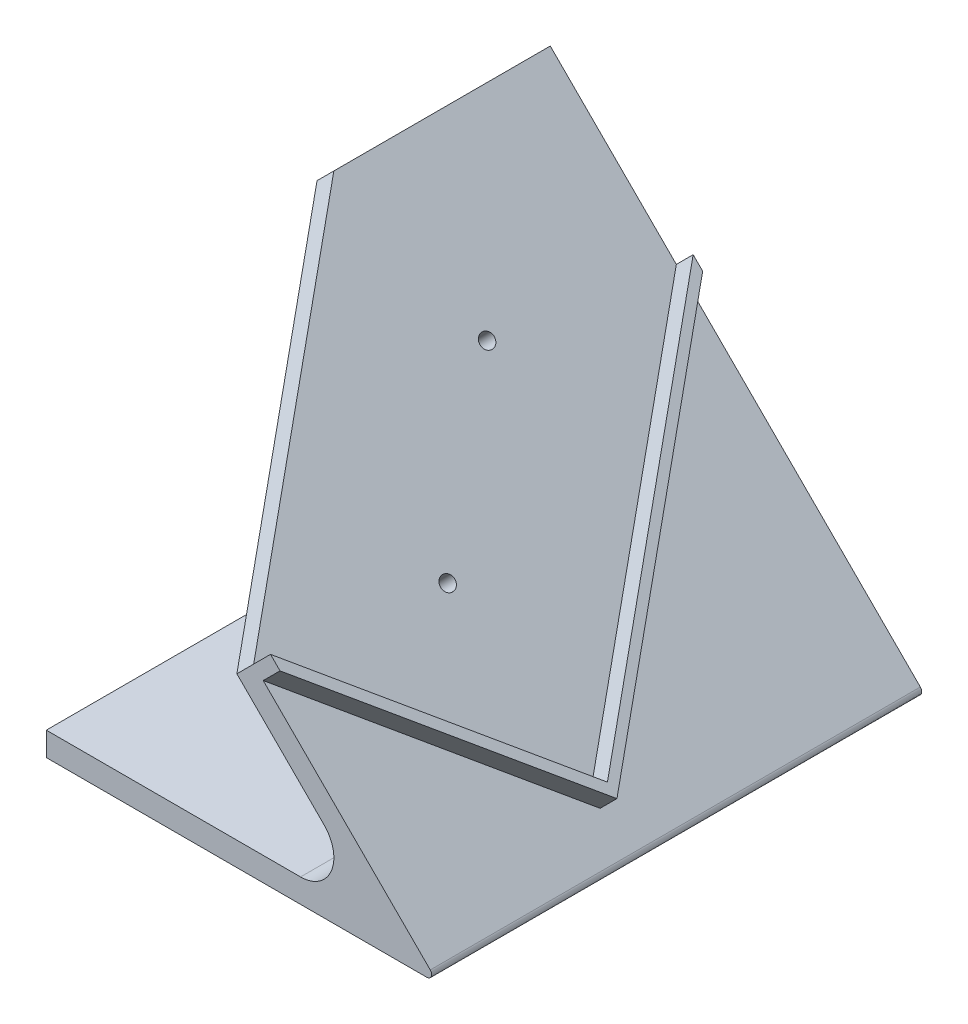
ISO-10303-21;
HEADER;
FILE_DESCRIPTION(('STEP AP214'),'2;1');
FILE_NAME('part.step','',(''),(''),'','','');
FILE_SCHEMA(('AUTOMOTIVE_DESIGN { 1 0 10303 214 1 1 1 1 }'));
ENDSEC;
DATA;
#1=APPLICATION_CONTEXT('core data for automotive mechanical design processes');
#2=APPLICATION_PROTOCOL_DEFINITION('international standard','automotive_design',2000,#1);
#3=PRODUCT_CONTEXT('',#1,'mechanical');
#4=PRODUCT('Part','Part','',(#3));
#5=PRODUCT_RELATED_PRODUCT_CATEGORY('part','',(#4));
#6=PRODUCT_DEFINITION_FORMATION('','',#4);
#7=PRODUCT_DEFINITION_CONTEXT('part definition',#1,'design');
#8=PRODUCT_DEFINITION('design','',#6,#7);
#9=PRODUCT_DEFINITION_SHAPE('','',#8);
#10=(LENGTH_UNIT() NAMED_UNIT(*) SI_UNIT(.MILLI.,.METRE.));
#11=(NAMED_UNIT(*) PLANE_ANGLE_UNIT() SI_UNIT($,.RADIAN.));
#12=(NAMED_UNIT(*) SI_UNIT($,.STERADIAN.) SOLID_ANGLE_UNIT());
#13=UNCERTAINTY_MEASURE_WITH_UNIT(LENGTH_MEASURE(1.E-05),#10,'distance_accuracy_value','');
#14=(GEOMETRIC_REPRESENTATION_CONTEXT(3) GLOBAL_UNCERTAINTY_ASSIGNED_CONTEXT((#13)) GLOBAL_UNIT_ASSIGNED_CONTEXT((#10,
#11,#12)) REPRESENTATION_CONTEXT('',''));
#15=CARTESIAN_POINT('',(0.,0.,0.));
#16=DIRECTION('',(0.,0.,1.));
#17=DIRECTION('',(1.,0.,0.));
#18=AXIS2_PLACEMENT_3D('',#15,#16,#17);
#19=CARTESIAN_POINT('',(2.92536085066658,74.4888527117072,103.));
#20=DIRECTION('',(-0.707106781186549,-0.707106781186546,0.));
#21=DIRECTION('',(0.707106781186546,-0.707106781186549,0.));
#22=AXIS2_PLACEMENT_3D('',#19,#20,#21);
#23=PLANE('',#22);
#24=CARTESIAN_POINT('',(46.4253608506667,30.9888527117069,65.0538238691621));
#25=DIRECTION('',(0.707106781186549,0.707106781186546,0.));
#26=DIRECTION('',(-0.707106781186546,0.707106781186549,0.));
#27=AXIS2_PLACEMENT_3D('',#24,#25,#26);
#28=CIRCLE('',#27,1.49999999999999);
#29=CARTESIAN_POINT('',(45.3647006788869,32.0495128834867,65.0538238691621));
#30=VERTEX_POINT('',#29);
#31=EDGE_CURVE('E454',#30,#30,#28,.T.);
#32=ORIENTED_EDGE('',*,*,#31,.F.);
#33=EDGE_LOOP('',(#32));
#34=FACE_BOUND('',#33,.T.);
#35=CARTESIAN_POINT('',(26.4253608506667,50.988852711707,36.7695526217004));
#36=DIRECTION('',(0.707106781186549,0.707106781186546,0.));
#37=DIRECTION('',(-0.707106781186546,0.707106781186549,0.));
#38=AXIS2_PLACEMENT_3D('',#35,#36,#37);
#39=CIRCLE('',#38,1.49999999999999);
#40=CARTESIAN_POINT('',(25.3647006788869,52.0495128834869,36.7695526217004));
#41=VERTEX_POINT('',#40);
#42=EDGE_CURVE('E456',#41,#41,#39,.T.);
#43=ORIENTED_EDGE('',*,*,#42,.F.);
#44=EDGE_LOOP('',(#43));
#45=FACE_BOUND('',#44,.T.);
#46=DIRECTION('',(0.500000000000002,-0.500000000000004,0.707106781186544));
#47=VECTOR('',#46,1.);
#48=CARTESIAN_POINT('',(43.5933623884523,33.8208511739213,103.));
#49=LINE('',#48,#47);
#50=CARTESIAN_POINT('',(2.92536085066658,74.4888527117072,45.486760670654));
#51=VERTEX_POINT('',#50);
#52=CARTESIAN_POINT('',(43.5933623884523,33.8208511739213,103.));
#53=VERTEX_POINT('',#52);
#54=EDGE_CURVE('E163',#51,#53,#49,.T.);
#55=ORIENTED_EDGE('',*,*,#54,.T.);
#56=DIRECTION('',(0.499999999999996,-0.499999999999998,-0.707106781186552));
#57=VECTOR('',#56,1.);
#58=CARTESIAN_POINT('',(77.5662338159268,-0.152020253553244,54.9551044745076));
#59=LINE('',#58,#57);
#60=CARTESIAN_POINT('',(72.9253608506666,4.48885271170697,61.5182899632293));
#61=VERTEX_POINT('',#60);
#62=EDGE_CURVE('E139',#53,#61,#59,.T.);
#63=ORIENTED_EDGE('',*,*,#62,.T.);
#64=DIRECTION('',(-0.500000000000003,0.500000000000005,-0.707106781186542));
#65=VECTOR('',#64,1.);
#66=CARTESIAN_POINT('',(34.0662338159267,43.347979746447,6.56318548872171));
#67=LINE('',#66,#65);
#68=CARTESIAN_POINT('',(29.4253608506664,47.9888527117073,0.));
#69=VERTEX_POINT('',#68);
#70=EDGE_CURVE('E151',#61,#69,#67,.T.);
#71=ORIENTED_EDGE('',*,*,#70,.T.);
#72=DIRECTION('',(-0.707106781186546,0.707106781186549,0.));
#73=VECTOR('',#72,1.);
#74=CARTESIAN_POINT('',(2.92536085066658,74.4888527117072,0.));
#75=LINE('',#74,#73);
#76=CARTESIAN_POINT('',(2.92536085066658,74.4888527117072,0.));
#77=VERTEX_POINT('',#76);
#78=EDGE_CURVE('E223',#69,#77,#75,.T.);
#79=ORIENTED_EDGE('',*,*,#78,.T.);
#80=DIRECTION('',(0.,0.,-1.));
#81=VECTOR('',#80,1.);
#82=CARTESIAN_POINT('',(2.92536085066658,74.4888527117072,103.));
#83=LINE('',#82,#81);
#84=EDGE_CURVE('E43',#51,#77,#83,.T.);
#85=ORIENTED_EDGE('',*,*,#84,.F.);
#86=EDGE_LOOP('',(#55,#63,#71,#79,#85));
#87=FACE_BOUND('',#86,.T.);
#88=ADVANCED_FACE('F35',(#34,#45,#87),#23,.F.);
#89=CARTESIAN_POINT('',(2.92536085066658,74.4888527117072,103.));
#90=DIRECTION('',(0.707106781186544,-0.707106781186551,0.));
#91=DIRECTION('',(0.707106781186551,0.707106781186544,0.));
#92=AXIS2_PLACEMENT_3D('',#89,#90,#91);
#93=PLANE('',#92);
#94=DIRECTION('',(-0.707106781186549,-0.707106781186546,0.));
#95=VECTOR('',#94,1.);
#96=CARTESIAN_POINT('',(138.6747221853,210.238214046341,45.486760670654));
#97=LINE('',#96,#95);
#98=CARTESIAN_POINT('',(-0.610173055266174,70.9533188057745,45.486760670654));
#99=VERTEX_POINT('',#98);
#100=EDGE_CURVE('E50',#51,#99,#97,.T.);
#101=ORIENTED_EDGE('',*,*,#100,.F.);
#102=ORIENTED_EDGE('',*,*,#84,.T.);
#103=DIRECTION('',(-0.707106781186551,-0.707106781186544,0.));
#104=VECTOR('',#103,1.);
#105=CARTESIAN_POINT('',(2.92536085066658,74.4888527117072,0.));
#106=LINE('',#105,#104);
#107=CARTESIAN_POINT('',(-0.610173055266174,70.9533188057745,0.));
#108=VERTEX_POINT('',#107);
#109=EDGE_CURVE('E226',#77,#108,#106,.T.);
#110=ORIENTED_EDGE('',*,*,#109,.T.);
#111=DIRECTION('',(0.,0.,-1.));
#112=VECTOR('',#111,1.);
#113=CARTESIAN_POINT('',(-0.610173055266174,70.9533188057745,103.));
#114=LINE('',#113,#112);
#115=EDGE_CURVE('E252',#99,#108,#114,.T.);
#116=ORIENTED_EDGE('',*,*,#115,.F.);
#117=EDGE_LOOP('',(#101,#102,#110,#116));
#118=FACE_BOUND('',#117,.T.);
#119=ADVANCED_FACE('F253',(#118),#93,.F.);
#120=CARTESIAN_POINT('',(58.3933982822023,11.9497474683058,103.));
#121=DIRECTION('',(0.707106781186549,0.707106781186546,0.));
#122=DIRECTION('',(-0.707106781186546,0.707106781186549,0.));
#123=AXIS2_PLACEMENT_3D('',#120,#121,#122);
#124=PLANE('',#123);
#125=CARTESIAN_POINT('',(42.889826944734,27.4533188057742,65.0538238691621));
#126=DIRECTION('',(0.707106781186549,0.707106781186546,0.));
#127=DIRECTION('',(-0.707106781186546,0.707106781186549,0.));
#128=AXIS2_PLACEMENT_3D('',#125,#126,#127);
#129=CIRCLE('',#128,1.49999999999999);
#130=CARTESIAN_POINT('',(41.8291667729542,28.513978977554,65.0538238691621));
#131=VERTEX_POINT('',#130);
#132=EDGE_CURVE('E452',#131,#131,#129,.T.);
#133=ORIENTED_EDGE('',*,*,#132,.T.);
#134=EDGE_LOOP('',(#133));
#135=FACE_BOUND('',#134,.T.);
#136=CARTESIAN_POINT('',(22.8898269447339,47.4533188057743,36.7695526217004));
#137=DIRECTION('',(0.707106781186549,0.707106781186546,0.));
#138=DIRECTION('',(-0.707106781186546,0.707106781186549,0.));
#139=AXIS2_PLACEMENT_3D('',#136,#137,#138);
#140=CIRCLE('',#139,1.49999999999999);
#141=CARTESIAN_POINT('',(21.8291667729541,48.5139789775541,36.7695526217004));
#142=VERTEX_POINT('',#141);
#143=EDGE_CURVE('E166',#142,#142,#140,.T.);
#144=ORIENTED_EDGE('',*,*,#143,.T.);
#145=EDGE_LOOP('',(#144));
#146=FACE_BOUND('',#145,.T.);
#147=DIRECTION('',(0.500000000000002,-0.500000000000004,0.707106781186544));
#148=VECTOR('',#147,1.);
#149=CARTESIAN_POINT('',(40.0578284825196,30.2853172679886,103.));
#150=LINE('',#149,#148);
#151=CARTESIAN_POINT('',(40.0578284825196,30.2853172679886,103.));
#152=VERTEX_POINT('',#151);
#153=EDGE_CURVE('E58',#99,#152,#150,.T.);
#154=ORIENTED_EDGE('',*,*,#153,.F.);
#155=ORIENTED_EDGE('',*,*,#115,.T.);
#156=DIRECTION('',(0.707106781186546,-0.707106781186549,0.));
#157=VECTOR('',#156,1.);
#158=CARTESIAN_POINT('',(58.3933982822023,11.9497474683058,0.));
#159=LINE('',#158,#157);
#160=CARTESIAN_POINT('',(58.3933982822023,11.9497474683058,0.));
#161=VERTEX_POINT('',#160);
#162=EDGE_CURVE('E229',#108,#161,#159,.T.);
#163=ORIENTED_EDGE('',*,*,#162,.T.);
#164=DIRECTION('',(0.,0.,-1.));
#165=VECTOR('',#164,1.);
#166=CARTESIAN_POINT('',(58.3933982822023,11.9497474683058,103.));
#167=LINE('',#166,#165);
#168=CARTESIAN_POINT('',(58.3933982822023,11.9497474683058,103.));
#169=VERTEX_POINT('',#168);
#170=EDGE_CURVE('E249',#169,#161,#167,.T.);
#171=ORIENTED_EDGE('',*,*,#170,.F.);
#172=DIRECTION('',(0.707106781186546,-0.707106781186549,0.));
#173=VECTOR('',#172,1.);
#174=CARTESIAN_POINT('',(58.3933982822023,11.9497474683058,103.));
#175=LINE('',#174,#173);
#176=EDGE_CURVE('E210',#152,#169,#175,.T.);
#177=ORIENTED_EDGE('',*,*,#176,.F.);
#178=EDGE_LOOP('',(#154,#155,#163,#171,#177));
#179=FACE_BOUND('',#178,.T.);
#180=ADVANCED_FACE('F263',(#135,#146,#179),#124,.F.);
#181=CARTESIAN_POINT('',(80.,-3.99999999999982,103.));
#182=DIRECTION('',(0.,0.,-1.));
#183=DIRECTION('',(-1.,0.,0.));
#184=AXIS2_PLACEMENT_3D('',#181,#182,#183);
#185=PLANE('',#184);
#186=DIRECTION('',(-0.707106781186549,-0.707106781186546,0.));
#187=VECTOR('',#186,1.);
#188=CARTESIAN_POINT('',(179.342723723086,169.570212508555,103.));
#189=LINE('',#188,#187);
#190=EDGE_CURVE('E156',#53,#152,#189,.T.);
#191=ORIENTED_EDGE('',*,*,#190,.T.);
#192=ORIENTED_EDGE('',*,*,#176,.T.);
#193=CARTESIAN_POINT('',(53.4436508138965,7.,103.));
#194=DIRECTION('',(0.,0.,-1.));
#195=DIRECTION('',(1.,0.,0.));
#196=AXIS2_PLACEMENT_3D('',#193,#194,#195);
#197=CIRCLE('',#196,7.);
#198=CARTESIAN_POINT('',(53.4436508138965,0.,103.));
#199=VERTEX_POINT('',#198);
#200=EDGE_CURVE('E212',#169,#199,#197,.T.);
#201=ORIENTED_EDGE('',*,*,#200,.T.);
#202=DIRECTION('',(-1.,0.,0.));
#203=VECTOR('',#202,1.);
#204=CARTESIAN_POINT('',(0.,0.,103.));
#205=LINE('',#204,#203);
#206=CARTESIAN_POINT('',(0.,0.,103.));
#207=VERTEX_POINT('',#206);
#208=EDGE_CURVE('E214',#199,#207,#205,.T.);
#209=ORIENTED_EDGE('',*,*,#208,.T.);
#210=DIRECTION('',(0.,-1.,0.));
#211=VECTOR('',#210,1.);
#212=CARTESIAN_POINT('',(0.,-5.,103.));
#213=LINE('',#212,#211);
#214=CARTESIAN_POINT('',(0.,-5.,103.));
#215=VERTEX_POINT('',#214);
#216=EDGE_CURVE('E216',#207,#215,#213,.T.);
#217=ORIENTED_EDGE('',*,*,#216,.T.);
#218=DIRECTION('',(1.,0.,0.));
#219=VECTOR('',#218,1.);
#220=CARTESIAN_POINT('',(80.,-4.99999999999999,103.));
#221=LINE('',#220,#219);
#222=CARTESIAN_POINT('',(80.,-4.99999999999999,103.));
#223=VERTEX_POINT('',#222);
#224=EDGE_CURVE('E218',#215,#223,#221,.T.);
#225=ORIENTED_EDGE('',*,*,#224,.T.);
#226=CARTESIAN_POINT('',(80.,-3.99999999999982,103.));
#227=DIRECTION('',(0.,0.,1.));
#228=DIRECTION('',(-1.,0.,0.));
#229=AXIS2_PLACEMENT_3D('',#226,#227,#228);
#230=CIRCLE('',#229,1.00000000000017);
#231=CARTESIAN_POINT('',(80.7071067811867,-3.29289321881315,103.));
#232=VERTEX_POINT('',#231);
#233=EDGE_CURVE('E203',#223,#232,#230,.T.);
#234=ORIENTED_EDGE('',*,*,#233,.T.);
#235=DIRECTION('',(-0.707106781186546,0.707106781186549,0.));
#236=VECTOR('',#235,1.);
#237=CARTESIAN_POINT('',(2.92536085066658,74.4888527117072,103.));
#238=LINE('',#237,#236);
#239=CARTESIAN_POINT('',(45.5933623884522,31.8208511739214,103.));
#240=VERTEX_POINT('',#239);
#241=EDGE_CURVE('E206',#232,#240,#238,.T.);
#242=ORIENTED_EDGE('',*,*,#241,.T.);
#243=DIRECTION('',(-0.707106781186549,-0.707106781186546,0.));
#244=VECTOR('',#243,1.);
#245=CARTESIAN_POINT('',(49.1288962943849,35.3563850798542,103.));
#246=LINE('',#245,#244);
#247=CARTESIAN_POINT('',(49.1288962943849,35.3563850798542,103.));
#248=VERTEX_POINT('',#247);
#249=EDGE_CURVE('E160',#248,#240,#246,.T.);
#250=ORIENTED_EDGE('',*,*,#249,.F.);
#251=DIRECTION('',(0.707106781186546,-0.707106781186549,0.));
#252=VECTOR('',#251,1.);
#253=CARTESIAN_POINT('',(42.2426406871196,42.2426406871195,103.));
#254=LINE('',#253,#252);
#255=CARTESIAN_POINT('',(47.1288962943851,37.356385079854,103.));
#256=VERTEX_POINT('',#255);
#257=EDGE_CURVE('E158',#256,#248,#254,.T.);
#258=ORIENTED_EDGE('',*,*,#257,.F.);
#259=DIRECTION('',(-0.707106781186549,-0.707106781186546,0.));
#260=VECTOR('',#259,1.);
#261=CARTESIAN_POINT('',(47.1288962943851,37.356385079854,103.));
#262=LINE('',#261,#260);
#263=EDGE_CURVE('E143',#256,#53,#262,.T.);
#264=ORIENTED_EDGE('',*,*,#263,.T.);
#265=EDGE_LOOP('',(#191,#192,#201,#209,#217,#225,#234,#242,#250,#258,#264));
#266=FACE_BOUND('',#265,.T.);
#267=ADVANCED_FACE('F154',(#266),#185,.F.);
#268=DIRECTION('',(0.499999999999997,-0.499999999999998,-0.707106781186551));
#269=VECTOR('',#268,1.);
#270=CARTESIAN_POINT('',(78.5662338159267,-1.15202025355317,56.3693180368806));
#271=LINE('',#270,#269);
#272=CARTESIAN_POINT('',(74.9253608506665,2.48885271170702,61.5182899632292));
#273=VERTEX_POINT('',#272);
#274=EDGE_CURVE('E150',#240,#273,#271,.T.);
#275=ORIENTED_EDGE('',*,*,#274,.F.);
#276=ORIENTED_EDGE('',*,*,#241,.F.);
#277=DIRECTION('',(0.,0.,-1.));
#278=VECTOR('',#277,1.);
#279=CARTESIAN_POINT('',(80.7071067811867,-3.29289321881315,103.));
#280=LINE('',#279,#278);
#281=CARTESIAN_POINT('',(80.7071067811867,-3.29289321881315,0.));
#282=VERTEX_POINT('',#281);
#283=EDGE_CURVE('E11',#232,#282,#280,.T.);
#284=ORIENTED_EDGE('',*,*,#283,.T.);
#285=CARTESIAN_POINT('',(31.4253608506664,45.9888527117073,0.));
#286=VERTEX_POINT('',#285);
#287=EDGE_CURVE('E224',#282,#286,#75,.T.);
#288=ORIENTED_EDGE('',*,*,#287,.T.);
#289=DIRECTION('',(-0.500000000000002,0.500000000000004,-0.707106781186544));
#290=VECTOR('',#289,1.);
#291=CARTESIAN_POINT('',(35.0662338159267,42.347979746447,5.14897192634861));
#292=LINE('',#291,#290);
#293=EDGE_CURVE('E177',#273,#286,#292,.T.);
#294=ORIENTED_EDGE('',*,*,#293,.F.);
#295=EDGE_LOOP('',(#275,#276,#284,#288,#294));
#296=FACE_BOUND('',#295,.T.);
#297=ADVANCED_FACE('F286',(#296),#23,.F.);
#298=CARTESIAN_POINT('',(80.,-3.99999999999982,103.));
#299=DIRECTION('',(0.,0.,-1.));
#300=DIRECTION('',(-1.,0.,0.));
#301=AXIS2_PLACEMENT_3D('',#298,#299,#300);
#302=CYLINDRICAL_SURFACE('',#301,1.00000000000017);
#303=CARTESIAN_POINT('',(80.,-3.99999999999982,0.));
#304=DIRECTION('',(0.,0.,1.));
#305=DIRECTION('',(-1.,0.,0.));
#306=AXIS2_PLACEMENT_3D('',#303,#304,#305);
#307=CIRCLE('',#306,1.00000000000017);
#308=CARTESIAN_POINT('',(80.,-4.99999999999999,0.));
#309=VERTEX_POINT('',#308);
#310=EDGE_CURVE('E202',#309,#282,#307,.T.);
#311=ORIENTED_EDGE('',*,*,#310,.T.);
#312=ORIENTED_EDGE('',*,*,#283,.F.);
#313=ORIENTED_EDGE('',*,*,#233,.F.);
#314=DIRECTION('',(0.,0.,-1.));
#315=VECTOR('',#314,1.);
#316=CARTESIAN_POINT('',(80.,-4.99999999999999,103.));
#317=LINE('',#316,#315);
#318=EDGE_CURVE('E220',#223,#309,#317,.T.);
#319=ORIENTED_EDGE('',*,*,#318,.T.);
#320=EDGE_LOOP('',(#311,#312,#313,#319));
#321=FACE_BOUND('',#320,.T.);
#322=ADVANCED_FACE('F37',(#321),#302,.T.);
#323=CARTESIAN_POINT('',(53.4436508138965,7.,103.));
#324=DIRECTION('',(0.,0.,-1.));
#325=DIRECTION('',(-1.,0.,0.));
#326=AXIS2_PLACEMENT_3D('',#323,#324,#325);
#327=CYLINDRICAL_SURFACE('',#326,7.);
#328=CARTESIAN_POINT('',(53.4436508138965,7.,0.));
#329=DIRECTION('',(0.,0.,-1.));
#330=DIRECTION('',(1.,0.,0.));
#331=AXIS2_PLACEMENT_3D('',#328,#329,#330);
#332=CIRCLE('',#331,7.);
#333=CARTESIAN_POINT('',(53.4436508138965,0.,0.));
#334=VERTEX_POINT('',#333);
#335=EDGE_CURVE('E231',#161,#334,#332,.T.);
#336=ORIENTED_EDGE('',*,*,#335,.T.);
#337=DIRECTION('',(0.,0.,-1.));
#338=VECTOR('',#337,1.);
#339=CARTESIAN_POINT('',(53.4436508138965,0.,103.));
#340=LINE('',#339,#338);
#341=EDGE_CURVE('E246',#199,#334,#340,.T.);
#342=ORIENTED_EDGE('',*,*,#341,.F.);
#343=ORIENTED_EDGE('',*,*,#200,.F.);
#344=ORIENTED_EDGE('',*,*,#170,.T.);
#345=EDGE_LOOP('',(#336,#342,#343,#344));
#346=FACE_BOUND('',#345,.T.);
#347=ADVANCED_FACE('F266',(#346),#327,.F.);
#348=CARTESIAN_POINT('',(0.,0.,103.));
#349=DIRECTION('',(0.,-1.,0.));
#350=DIRECTION('',(0.,0.,-1.));
#351=AXIS2_PLACEMENT_3D('',#348,#349,#350);
#352=PLANE('',#351);
#353=DIRECTION('',(-1.,0.,0.));
#354=VECTOR('',#353,1.);
#355=CARTESIAN_POINT('',(0.,0.,0.));
#356=LINE('',#355,#354);
#357=CARTESIAN_POINT('',(0.,0.,0.));
#358=VERTEX_POINT('',#357);
#359=EDGE_CURVE('E233',#334,#358,#356,.T.);
#360=ORIENTED_EDGE('',*,*,#359,.T.);
#361=DIRECTION('',(0.,0.,-1.));
#362=VECTOR('',#361,1.);
#363=CARTESIAN_POINT('',(0.,0.,103.));
#364=LINE('',#363,#362);
#365=EDGE_CURVE('E243',#207,#358,#364,.T.);
#366=ORIENTED_EDGE('',*,*,#365,.F.);
#367=ORIENTED_EDGE('',*,*,#208,.F.);
#368=ORIENTED_EDGE('',*,*,#341,.T.);
#369=EDGE_LOOP('',(#360,#366,#367,#368));
#370=FACE_BOUND('',#369,.T.);
#371=ADVANCED_FACE('F273',(#370),#352,.F.);
#372=CARTESIAN_POINT('',(0.,-5.,103.));
#373=DIRECTION('',(1.,0.,0.));
#374=DIRECTION('',(0.,0.,-1.));
#375=AXIS2_PLACEMENT_3D('',#372,#373,#374);
#376=PLANE('',#375);
#377=DIRECTION('',(0.,-1.,0.));
#378=VECTOR('',#377,1.);
#379=CARTESIAN_POINT('',(0.,-5.,0.));
#380=LINE('',#379,#378);
#381=CARTESIAN_POINT('',(0.,-5.,0.));
#382=VERTEX_POINT('',#381);
#383=EDGE_CURVE('E235',#358,#382,#380,.T.);
#384=ORIENTED_EDGE('',*,*,#383,.T.);
#385=DIRECTION('',(0.,0.,-1.));
#386=VECTOR('',#385,1.);
#387=CARTESIAN_POINT('',(0.,-5.,103.));
#388=LINE('',#387,#386);
#389=EDGE_CURVE('E240',#215,#382,#388,.T.);
#390=ORIENTED_EDGE('',*,*,#389,.F.);
#391=ORIENTED_EDGE('',*,*,#216,.F.);
#392=ORIENTED_EDGE('',*,*,#365,.T.);
#393=EDGE_LOOP('',(#384,#390,#391,#392));
#394=FACE_BOUND('',#393,.T.);
#395=ADVANCED_FACE('F276',(#394),#376,.F.);
#396=CARTESIAN_POINT('',(80.,-4.99999999999999,103.));
#397=DIRECTION('',(0.,1.,0.));
#398=DIRECTION('',(-1.,0.,0.));
#399=AXIS2_PLACEMENT_3D('',#396,#397,#398);
#400=PLANE('',#399);
#401=DIRECTION('',(1.,0.,0.));
#402=VECTOR('',#401,1.);
#403=CARTESIAN_POINT('',(80.,-4.99999999999999,0.));
#404=LINE('',#403,#402);
#405=EDGE_CURVE('E207',#382,#309,#404,.T.);
#406=ORIENTED_EDGE('',*,*,#405,.T.);
#407=ORIENTED_EDGE('',*,*,#318,.F.);
#408=ORIENTED_EDGE('',*,*,#224,.F.);
#409=ORIENTED_EDGE('',*,*,#389,.T.);
#410=EDGE_LOOP('',(#406,#407,#408,#409));
#411=FACE_BOUND('',#410,.T.);
#412=ADVANCED_FACE('F281',(#411),#400,.F.);
#413=CARTESIAN_POINT('',(80.,-3.99999999999982,0.));
#414=DIRECTION('',(0.,0.,-1.));
#415=DIRECTION('',(-1.,0.,0.));
#416=AXIS2_PLACEMENT_3D('',#413,#414,#415);
#417=PLANE('',#416);
#418=ORIENTED_EDGE('',*,*,#310,.F.);
#419=ORIENTED_EDGE('',*,*,#405,.F.);
#420=ORIENTED_EDGE('',*,*,#383,.F.);
#421=ORIENTED_EDGE('',*,*,#359,.F.);
#422=ORIENTED_EDGE('',*,*,#335,.F.);
#423=ORIENTED_EDGE('',*,*,#162,.F.);
#424=ORIENTED_EDGE('',*,*,#109,.F.);
#425=ORIENTED_EDGE('',*,*,#78,.F.);
#426=DIRECTION('',(-0.707106781186549,-0.707106781186546,0.));
#427=VECTOR('',#426,1.);
#428=CARTESIAN_POINT('',(32.9608947565991,51.52438661764,0.));
#429=LINE('',#428,#427);
#430=CARTESIAN_POINT('',(32.9608947565991,51.52438661764,0.));
#431=VERTEX_POINT('',#430);
#432=EDGE_CURVE('E185',#431,#69,#429,.T.);
#433=ORIENTED_EDGE('',*,*,#432,.F.);
#434=DIRECTION('',(-0.707106781186546,0.707106781186549,0.));
#435=VECTOR('',#434,1.);
#436=CARTESIAN_POINT('',(42.2426406871196,42.2426406871195,0.));
#437=LINE('',#436,#435);
#438=CARTESIAN_POINT('',(34.9608947565991,49.52438661764,0.));
#439=VERTEX_POINT('',#438);
#440=EDGE_CURVE('E184',#439,#431,#437,.T.);
#441=ORIENTED_EDGE('',*,*,#440,.F.);
#442=DIRECTION('',(-0.707106781186549,-0.707106781186546,0.));
#443=VECTOR('',#442,1.);
#444=CARTESIAN_POINT('',(34.9608947565991,49.52438661764,0.));
#445=LINE('',#444,#443);
#446=EDGE_CURVE('E193',#439,#286,#445,.T.);
#447=ORIENTED_EDGE('',*,*,#446,.T.);
#448=ORIENTED_EDGE('',*,*,#287,.F.);
#449=EDGE_LOOP('',(#418,#419,#420,#421,#422,#423,#424,#425,#433,#441,#447,#448));
#450=FACE_BOUND('',#449,.T.);
#451=ADVANCED_FACE('F259',(#450),#417,.T.);
#452=CARTESIAN_POINT('',(37.6017677218594,46.8835136523797,6.56318548872171));
#453=DIRECTION('',(-0.499999999999995,0.499999999999997,0.707106781186553));
#454=DIRECTION('',(0.,-0.81649658092773,0.57735026918962));
#455=AXIS2_PLACEMENT_3D('',#452,#453,#454);
#456=PLANE('',#455);
#457=ORIENTED_EDGE('',*,*,#70,.F.);
#458=DIRECTION('',(-0.707106781186549,-0.707106781186546,0.));
#459=VECTOR('',#458,1.);
#460=CARTESIAN_POINT('',(76.4608947565993,8.02438661763972,61.5182899632293));
#461=LINE('',#460,#459);
#462=CARTESIAN_POINT('',(76.4608947565993,8.02438661763972,61.5182899632293));
#463=VERTEX_POINT('',#462);
#464=EDGE_CURVE('E145',#463,#61,#461,.T.);
#465=ORIENTED_EDGE('',*,*,#464,.F.);
#466=DIRECTION('',(-0.500000000000003,0.500000000000005,-0.707106781186542));
#467=VECTOR('',#466,1.);
#468=CARTESIAN_POINT('',(37.6017677218594,46.8835136523797,6.56318548872171));
#469=LINE('',#468,#467);
#470=EDGE_CURVE('E173',#463,#431,#469,.T.);
#471=ORIENTED_EDGE('',*,*,#470,.T.);
#472=ORIENTED_EDGE('',*,*,#432,.T.);
#473=EDGE_LOOP('',(#457,#465,#471,#472));
#474=FACE_BOUND('',#473,.T.);
#475=ADVANCED_FACE('F300',(#474),#456,.T.);
#476=CARTESIAN_POINT('',(81.1017677218595,3.38351365237949,54.9551044745076));
#477=DIRECTION('',(-0.500000000000002,0.500000000000004,-0.707106781186543));
#478=DIRECTION('',(0.,0.816496580927722,0.577350269189631));
#479=AXIS2_PLACEMENT_3D('',#476,#477,#478);
#480=PLANE('',#479);
#481=ORIENTED_EDGE('',*,*,#62,.F.);
#482=ORIENTED_EDGE('',*,*,#263,.F.);
#483=DIRECTION('',(0.499999999999996,-0.499999999999998,-0.707106781186552));
#484=VECTOR('',#483,1.);
#485=CARTESIAN_POINT('',(81.1017677218595,3.38351365237949,54.9551044745076));
#486=LINE('',#485,#484);
#487=EDGE_CURVE('E176',#256,#463,#486,.T.);
#488=ORIENTED_EDGE('',*,*,#487,.T.);
#489=ORIENTED_EDGE('',*,*,#464,.T.);
#490=EDGE_LOOP('',(#481,#482,#488,#489));
#491=FACE_BOUND('',#490,.T.);
#492=ADVANCED_FACE('F141',(#491),#480,.T.);
#493=CARTESIAN_POINT('',(82.1017677218595,2.38351365237956,56.3693180368806));
#494=DIRECTION('',(-0.500000000000002,0.500000000000003,-0.707106781186544));
#495=DIRECTION('',(0.,0.816496580927723,0.577350269189631));
#496=AXIS2_PLACEMENT_3D('',#493,#494,#495);
#497=PLANE('',#496);
#498=ORIENTED_EDGE('',*,*,#274,.T.);
#499=DIRECTION('',(-0.707106781186549,-0.707106781186546,0.));
#500=VECTOR('',#499,1.);
#501=CARTESIAN_POINT('',(78.4608947565993,6.02438661763977,61.5182899632292));
#502=LINE('',#501,#500);
#503=CARTESIAN_POINT('',(78.4608947565993,6.02438661763977,61.5182899632292));
#504=VERTEX_POINT('',#503);
#505=EDGE_CURVE('E196',#504,#273,#502,.T.);
#506=ORIENTED_EDGE('',*,*,#505,.F.);
#507=DIRECTION('',(0.499999999999997,-0.499999999999998,-0.707106781186551));
#508=VECTOR('',#507,1.);
#509=CARTESIAN_POINT('',(82.1017677218595,2.38351365237956,56.3693180368806));
#510=LINE('',#509,#508);
#511=EDGE_CURVE('E180',#248,#504,#510,.T.);
#512=ORIENTED_EDGE('',*,*,#511,.F.);
#513=ORIENTED_EDGE('',*,*,#249,.T.);
#514=EDGE_LOOP('',(#498,#506,#512,#513));
#515=FACE_BOUND('',#514,.T.);
#516=ADVANCED_FACE('F289',(#515),#497,.F.);
#517=CARTESIAN_POINT('',(38.6017677218594,45.8835136523797,5.14897192634861));
#518=DIRECTION('',(-0.499999999999996,0.499999999999998,0.707106781186552));
#519=DIRECTION('',(0.,-0.816496580927729,0.577350269189622));
#520=AXIS2_PLACEMENT_3D('',#517,#518,#519);
#521=PLANE('',#520);
#522=ORIENTED_EDGE('',*,*,#293,.T.);
#523=ORIENTED_EDGE('',*,*,#446,.F.);
#524=DIRECTION('',(-0.500000000000002,0.500000000000004,-0.707106781186544));
#525=VECTOR('',#524,1.);
#526=CARTESIAN_POINT('',(38.6017677218594,45.8835136523797,5.14897192634861));
#527=LINE('',#526,#525);
#528=EDGE_CURVE('E182',#504,#439,#527,.T.);
#529=ORIENTED_EDGE('',*,*,#528,.F.);
#530=ORIENTED_EDGE('',*,*,#505,.T.);
#531=EDGE_LOOP('',(#522,#523,#529,#530));
#532=FACE_BOUND('',#531,.T.);
#533=ADVANCED_FACE('F293',(#532),#521,.F.);
#534=CARTESIAN_POINT('',(42.2426406871196,42.2426406871195,0.));
#535=DIRECTION('',(0.707106781186549,0.707106781186546,0.));
#536=DIRECTION('',(-0.707106781186546,0.707106781186549,0.));
#537=AXIS2_PLACEMENT_3D('',#534,#535,#536);
#538=PLANE('',#537);
#539=ORIENTED_EDGE('',*,*,#470,.F.);
#540=ORIENTED_EDGE('',*,*,#487,.F.);
#541=ORIENTED_EDGE('',*,*,#257,.T.);
#542=ORIENTED_EDGE('',*,*,#511,.T.);
#543=ORIENTED_EDGE('',*,*,#528,.T.);
#544=ORIENTED_EDGE('',*,*,#440,.T.);
#545=EDGE_LOOP('',(#539,#540,#541,#542,#543,#544));
#546=FACE_BOUND('',#545,.T.);
#547=ADVANCED_FACE('F298',(#546),#538,.T.);
#548=CARTESIAN_POINT('',(179.342723723086,169.570212508555,103.));
#549=DIRECTION('',(-0.499999999999997,0.499999999999998,0.707106781186551));
#550=DIRECTION('',(0.,-0.816496580927728,0.577350269189622));
#551=AXIS2_PLACEMENT_3D('',#548,#549,#550);
#552=PLANE('',#551);
#553=ORIENTED_EDGE('',*,*,#54,.F.);
#554=ORIENTED_EDGE('',*,*,#100,.T.);
#555=ORIENTED_EDGE('',*,*,#153,.T.);
#556=ORIENTED_EDGE('',*,*,#190,.F.);
#557=EDGE_LOOP('',(#553,#554,#555,#556));
#558=FACE_BOUND('',#557,.T.);
#559=ADVANCED_FACE('F168',(#558),#552,.T.);
#560=CARTESIAN_POINT('',(26.4253608506667,50.988852711707,36.7695526217004));
#561=DIRECTION('',(0.707106781186549,0.707106781186546,0.));
#562=DIRECTION('',(-0.707106781186546,0.707106781186549,0.));
#563=AXIS2_PLACEMENT_3D('',#560,#561,#562);
#564=CYLINDRICAL_SURFACE('',#563,1.49999999999999);
#565=ORIENTED_EDGE('',*,*,#143,.F.);
#566=EDGE_LOOP('',(#565));
#567=FACE_BOUND('',#566,.T.);
#568=ORIENTED_EDGE('',*,*,#42,.T.);
#569=EDGE_LOOP('',(#568));
#570=FACE_BOUND('',#569,.T.);
#571=ADVANCED_FACE('F417',(#567,#570),#564,.F.);
#572=CARTESIAN_POINT('',(46.4253608506667,30.9888527117069,65.0538238691621));
#573=DIRECTION('',(0.707106781186549,0.707106781186546,0.));
#574=DIRECTION('',(-0.707106781186546,0.707106781186549,0.));
#575=AXIS2_PLACEMENT_3D('',#572,#573,#574);
#576=CYLINDRICAL_SURFACE('',#575,1.49999999999999);
#577=ORIENTED_EDGE('',*,*,#132,.F.);
#578=EDGE_LOOP('',(#577));
#579=FACE_BOUND('',#578,.T.);
#580=ORIENTED_EDGE('',*,*,#31,.T.);
#581=EDGE_LOOP('',(#580));
#582=FACE_BOUND('',#581,.T.);
#583=ADVANCED_FACE('F435',(#579,#582),#576,.F.);
#584=CLOSED_SHELL('',(#88,#119,#180,#267,#297,#322,#347,#371,#395,#412,#451,#475,#492,#516,#533,
#547,#559,#571,#583));
#585=MANIFOLD_SOLID_BREP('B2',#584);
#586=ADVANCED_BREP_SHAPE_REPRESENTATION('',(#18,#585),#14);
#587=SHAPE_DEFINITION_REPRESENTATION(#9,#586);
ENDSEC;
END-ISO-10303-21;
